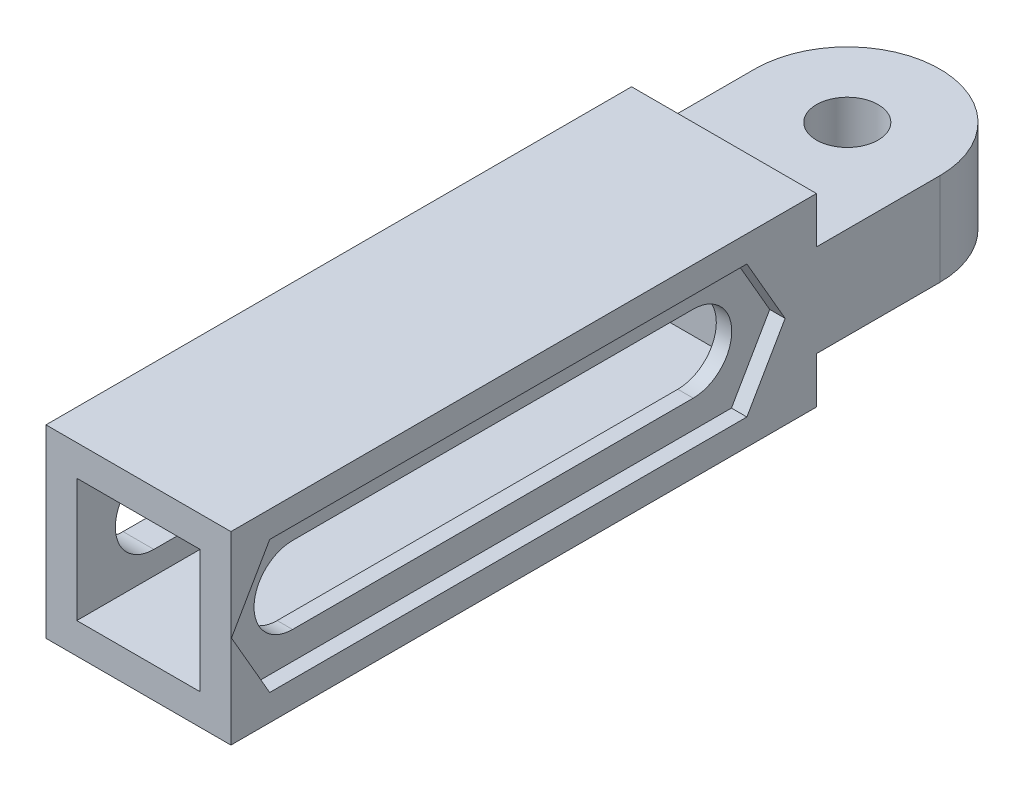
ISO-10303-21;
HEADER;
FILE_DESCRIPTION(('STEP AP214'),'2;1');
FILE_NAME('part.step','',(''),(''),'','','');
FILE_SCHEMA(('AUTOMOTIVE_DESIGN { 1 0 10303 214 1 1 1 1 }'));
ENDSEC;
DATA;
#1=APPLICATION_CONTEXT('core data for automotive mechanical design processes');
#2=APPLICATION_PROTOCOL_DEFINITION('international standard','automotive_design',2000,#1);
#3=PRODUCT_CONTEXT('',#1,'mechanical');
#4=PRODUCT('Part','Part','',(#3));
#5=PRODUCT_RELATED_PRODUCT_CATEGORY('part','',(#4));
#6=PRODUCT_DEFINITION_FORMATION('','',#4);
#7=PRODUCT_DEFINITION_CONTEXT('part definition',#1,'design');
#8=PRODUCT_DEFINITION('design','',#6,#7);
#9=PRODUCT_DEFINITION_SHAPE('','',#8);
#10=(LENGTH_UNIT() NAMED_UNIT(*) SI_UNIT(.MILLI.,.METRE.));
#11=(NAMED_UNIT(*) PLANE_ANGLE_UNIT() SI_UNIT($,.RADIAN.));
#12=(NAMED_UNIT(*) SI_UNIT($,.STERADIAN.) SOLID_ANGLE_UNIT());
#13=UNCERTAINTY_MEASURE_WITH_UNIT(LENGTH_MEASURE(1.E-05),#10,'distance_accuracy_value','');
#14=(GEOMETRIC_REPRESENTATION_CONTEXT(3) GLOBAL_UNCERTAINTY_ASSIGNED_CONTEXT((#13)) GLOBAL_UNIT_ASSIGNED_CONTEXT((#10,
#11,#12)) REPRESENTATION_CONTEXT('',''));
#15=CARTESIAN_POINT('',(0.,0.,0.));
#16=DIRECTION('',(0.,0.,1.));
#17=DIRECTION('',(1.,0.,0.));
#18=AXIS2_PLACEMENT_3D('',#15,#16,#17);
#19=CARTESIAN_POINT('',(18.7003184681076,0.,15.5));
#20=DIRECTION('',(-1.,0.,0.));
#21=DIRECTION('',(0.,-1.,0.));
#22=AXIS2_PLACEMENT_3D('',#19,#20,#21);
#23=CYLINDRICAL_SURFACE('',#22,1.25);
#24=CARTESIAN_POINT('',(2.5,0.,15.5));
#25=DIRECTION('',(1.,0.,0.));
#26=DIRECTION('',(0.,0.,-1.));
#27=AXIS2_PLACEMENT_3D('',#24,#25,#26);
#28=CIRCLE('',#27,1.25);
#29=CARTESIAN_POINT('',(2.5,-1.25,15.5));
#30=VERTEX_POINT('',#29);
#31=CARTESIAN_POINT('',(2.5,1.25,15.5));
#32=VERTEX_POINT('',#31);
#33=EDGE_CURVE('E55',#30,#32,#28,.F.);
#34=ORIENTED_EDGE('',*,*,#33,.F.);
#35=DIRECTION('',(-1.,0.,0.));
#36=VECTOR('',#35,1.);
#37=CARTESIAN_POINT('',(18.7003184681076,-1.25,15.5));
#38=LINE('',#37,#36);
#39=CARTESIAN_POINT('',(2.,-1.25,15.5));
#40=VERTEX_POINT('',#39);
#41=EDGE_CURVE('E277',#30,#40,#38,.T.);
#42=ORIENTED_EDGE('',*,*,#41,.T.);
#43=CARTESIAN_POINT('',(2.,0.,15.5));
#44=DIRECTION('',(-1.,0.,0.));
#45=DIRECTION('',(0.,0.,1.));
#46=AXIS2_PLACEMENT_3D('',#43,#44,#45);
#47=CIRCLE('',#46,1.25);
#48=CARTESIAN_POINT('',(2.,1.25,15.5));
#49=VERTEX_POINT('',#48);
#50=EDGE_CURVE('E297',#40,#49,#47,.T.);
#51=ORIENTED_EDGE('',*,*,#50,.T.);
#52=DIRECTION('',(-1.,0.,0.));
#53=VECTOR('',#52,1.);
#54=CARTESIAN_POINT('',(18.7003184681076,1.25,15.5));
#55=LINE('',#54,#53);
#56=EDGE_CURVE('E287',#32,#49,#55,.T.);
#57=ORIENTED_EDGE('',*,*,#56,.F.);
#58=EDGE_LOOP('',(#34,#42,#51,#57));
#59=FACE_BOUND('',#58,.T.);
#60=ADVANCED_FACE('F33',(#59),#23,.F.);
#61=CARTESIAN_POINT('',(18.7003184681076,-1.25,15.5));
#62=DIRECTION('',(0.,-1.,0.));
#63=DIRECTION('',(0.,0.,-1.));
#64=AXIS2_PLACEMENT_3D('',#61,#62,#63);
#65=PLANE('',#64);
#66=DIRECTION('',(0.,0.,1.));
#67=VECTOR('',#66,1.);
#68=CARTESIAN_POINT('',(2.5,-1.25,15.5));
#69=LINE('',#68,#67);
#70=CARTESIAN_POINT('',(2.5,-1.25,2.5));
#71=VERTEX_POINT('',#70);
#72=EDGE_CURVE('E262',#71,#30,#69,.T.);
#73=ORIENTED_EDGE('',*,*,#72,.F.);
#74=DIRECTION('',(-1.,0.,0.));
#75=VECTOR('',#74,1.);
#76=CARTESIAN_POINT('',(18.7003184681076,-1.25,2.5));
#77=LINE('',#76,#75);
#78=CARTESIAN_POINT('',(2.,-1.25,2.5));
#79=VERTEX_POINT('',#78);
#80=EDGE_CURVE('E281',#71,#79,#77,.T.);
#81=ORIENTED_EDGE('',*,*,#80,.T.);
#82=DIRECTION('',(0.,0.,1.));
#83=VECTOR('',#82,1.);
#84=CARTESIAN_POINT('',(2.,-1.25,18.));
#85=LINE('',#84,#83);
#86=EDGE_CURVE('E294',#79,#40,#85,.T.);
#87=ORIENTED_EDGE('',*,*,#86,.T.);
#88=ORIENTED_EDGE('',*,*,#41,.F.);
#89=EDGE_LOOP('',(#73,#81,#87,#88));
#90=FACE_BOUND('',#89,.T.);
#91=ADVANCED_FACE('F445',(#90),#65,.F.);
#92=CARTESIAN_POINT('',(18.7003184681076,0.,2.5));
#93=DIRECTION('',(-1.,0.,0.));
#94=DIRECTION('',(0.,-1.,0.));
#95=AXIS2_PLACEMENT_3D('',#92,#93,#94);
#96=CYLINDRICAL_SURFACE('',#95,1.25);
#97=CARTESIAN_POINT('',(2.5,0.,2.5));
#98=DIRECTION('',(1.,0.,0.));
#99=DIRECTION('',(0.,0.,-1.));
#100=AXIS2_PLACEMENT_3D('',#97,#98,#99);
#101=CIRCLE('',#100,1.25);
#102=CARTESIAN_POINT('',(2.5,1.25,2.5));
#103=VERTEX_POINT('',#102);
#104=EDGE_CURVE('E253',#103,#71,#101,.F.);
#105=ORIENTED_EDGE('',*,*,#104,.F.);
#106=DIRECTION('',(-1.,0.,0.));
#107=VECTOR('',#106,1.);
#108=CARTESIAN_POINT('',(18.7003184681076,1.25,2.5));
#109=LINE('',#108,#107);
#110=CARTESIAN_POINT('',(2.,1.25,2.5));
#111=VERTEX_POINT('',#110);
#112=EDGE_CURVE('E284',#103,#111,#109,.T.);
#113=ORIENTED_EDGE('',*,*,#112,.T.);
#114=CARTESIAN_POINT('',(2.,0.,2.5));
#115=DIRECTION('',(-1.,0.,0.));
#116=DIRECTION('',(0.,0.,1.));
#117=AXIS2_PLACEMENT_3D('',#114,#115,#116);
#118=CIRCLE('',#117,1.25);
#119=EDGE_CURVE('E291',#111,#79,#118,.T.);
#120=ORIENTED_EDGE('',*,*,#119,.T.);
#121=ORIENTED_EDGE('',*,*,#80,.F.);
#122=EDGE_LOOP('',(#105,#113,#120,#121));
#123=FACE_BOUND('',#122,.T.);
#124=ADVANCED_FACE('F436',(#123),#96,.F.);
#125=CARTESIAN_POINT('',(18.7003184681076,1.25,15.5));
#126=DIRECTION('',(0.,1.,0.));
#127=DIRECTION('',(0.,0.,1.));
#128=AXIS2_PLACEMENT_3D('',#125,#126,#127);
#129=PLANE('',#128);
#130=DIRECTION('',(0.,0.,-1.));
#131=VECTOR('',#130,1.);
#132=CARTESIAN_POINT('',(2.5,1.25,15.5));
#133=LINE('',#132,#131);
#134=EDGE_CURVE('E11',#32,#103,#133,.T.);
#135=ORIENTED_EDGE('',*,*,#134,.F.);
#136=ORIENTED_EDGE('',*,*,#56,.T.);
#137=DIRECTION('',(0.,0.,-1.));
#138=VECTOR('',#137,1.);
#139=CARTESIAN_POINT('',(2.,1.25,18.));
#140=LINE('',#139,#138);
#141=EDGE_CURVE('E279',#49,#111,#140,.T.);
#142=ORIENTED_EDGE('',*,*,#141,.T.);
#143=ORIENTED_EDGE('',*,*,#112,.F.);
#144=EDGE_LOOP('',(#135,#136,#142,#143));
#145=FACE_BOUND('',#144,.T.);
#146=ADVANCED_FACE('F430',(#145),#129,.F.);
#147=CARTESIAN_POINT('',(0.,0.,-1.));
#148=DIRECTION('',(0.,0.,1.));
#149=DIRECTION('',(1.,0.,0.));
#150=AXIS2_PLACEMENT_3D('',#147,#148,#149);
#151=PLANE('',#150);
#152=DIRECTION('',(1.,0.,0.));
#153=VECTOR('',#152,1.);
#154=CARTESIAN_POINT('',(3.,1.5,-1.));
#155=LINE('',#154,#153);
#156=CARTESIAN_POINT('',(-3.,1.5,-1.));
#157=VERTEX_POINT('',#156);
#158=CARTESIAN_POINT('',(3.,1.5,-1.));
#159=VERTEX_POINT('',#158);
#160=EDGE_CURVE('E308',#157,#159,#155,.T.);
#161=ORIENTED_EDGE('',*,*,#160,.F.);
#162=DIRECTION('',(0.,1.,0.));
#163=VECTOR('',#162,1.);
#164=CARTESIAN_POINT('',(-3.,3.,-1.));
#165=LINE('',#164,#163);
#166=CARTESIAN_POINT('',(-3.,3.,-1.));
#167=VERTEX_POINT('',#166);
#168=EDGE_CURVE('E331',#157,#167,#165,.T.);
#169=ORIENTED_EDGE('',*,*,#168,.T.);
#170=DIRECTION('',(1.,0.,0.));
#171=VECTOR('',#170,1.);
#172=CARTESIAN_POINT('',(-3.,3.,-1.));
#173=LINE('',#172,#171);
#174=CARTESIAN_POINT('',(3.,3.,-1.));
#175=VERTEX_POINT('',#174);
#176=EDGE_CURVE('E336',#167,#175,#173,.T.);
#177=ORIENTED_EDGE('',*,*,#176,.T.);
#178=DIRECTION('',(0.,-1.,0.));
#179=VECTOR('',#178,1.);
#180=CARTESIAN_POINT('',(3.,3.,-1.));
#181=LINE('',#180,#179);
#182=EDGE_CURVE('E340',#175,#159,#181,.T.);
#183=ORIENTED_EDGE('',*,*,#182,.T.);
#184=EDGE_LOOP('',(#161,#169,#177,#183));
#185=FACE_BOUND('',#184,.T.);
#186=ADVANCED_FACE('F442',(#185),#151,.F.);
#187=CARTESIAN_POINT('',(0.,0.,18.));
#188=DIRECTION('',(0.,0.,-1.));
#189=DIRECTION('',(-1.,0.,0.));
#190=AXIS2_PLACEMENT_3D('',#187,#188,#189);
#191=PLANE('',#190);
#192=DIRECTION('',(0.,1.,0.));
#193=VECTOR('',#192,1.);
#194=CARTESIAN_POINT('',(3.,3.,18.));
#195=LINE('',#194,#193);
#196=CARTESIAN_POINT('',(3.,-3.,18.));
#197=VERTEX_POINT('',#196);
#198=CARTESIAN_POINT('',(3.,3.,18.));
#199=VERTEX_POINT('',#198);
#200=EDGE_CURVE('E376',#197,#199,#195,.T.);
#201=ORIENTED_EDGE('',*,*,#200,.T.);
#202=DIRECTION('',(-1.,0.,0.));
#203=VECTOR('',#202,1.);
#204=CARTESIAN_POINT('',(3.,3.,18.));
#205=LINE('',#204,#203);
#206=CARTESIAN_POINT('',(-3.,3.,18.));
#207=VERTEX_POINT('',#206);
#208=EDGE_CURVE('E379',#199,#207,#205,.T.);
#209=ORIENTED_EDGE('',*,*,#208,.T.);
#210=DIRECTION('',(0.,-1.,0.));
#211=VECTOR('',#210,1.);
#212=CARTESIAN_POINT('',(-3.,3.,18.));
#213=LINE('',#212,#211);
#214=CARTESIAN_POINT('',(-3.,-3.,18.));
#215=VERTEX_POINT('',#214);
#216=EDGE_CURVE('E381',#207,#215,#213,.T.);
#217=ORIENTED_EDGE('',*,*,#216,.T.);
#218=DIRECTION('',(1.,0.,0.));
#219=VECTOR('',#218,1.);
#220=CARTESIAN_POINT('',(3.,-3.,18.));
#221=LINE('',#220,#219);
#222=EDGE_CURVE('E383',#215,#197,#221,.T.);
#223=ORIENTED_EDGE('',*,*,#222,.T.);
#224=EDGE_LOOP('',(#201,#209,#217,#223));
#225=FACE_BOUND('',#224,.T.);
#226=DIRECTION('',(0.,1.,0.));
#227=VECTOR('',#226,1.);
#228=CARTESIAN_POINT('',(2.,2.,18.));
#229=LINE('',#228,#227);
#230=CARTESIAN_POINT('',(2.,-2.,18.));
#231=VERTEX_POINT('',#230);
#232=CARTESIAN_POINT('',(2.,2.,18.));
#233=VERTEX_POINT('',#232);
#234=EDGE_CURVE('E347',#231,#233,#229,.T.);
#235=ORIENTED_EDGE('',*,*,#234,.F.);
#236=DIRECTION('',(1.,0.,0.));
#237=VECTOR('',#236,1.);
#238=CARTESIAN_POINT('',(2.,-2.,18.));
#239=LINE('',#238,#237);
#240=CARTESIAN_POINT('',(-2.,-2.,18.));
#241=VERTEX_POINT('',#240);
#242=EDGE_CURVE('E355',#241,#231,#239,.T.);
#243=ORIENTED_EDGE('',*,*,#242,.F.);
#244=DIRECTION('',(0.,-1.,0.));
#245=VECTOR('',#244,1.);
#246=CARTESIAN_POINT('',(-2.,2.,18.));
#247=LINE('',#246,#245);
#248=CARTESIAN_POINT('',(-2.,2.,18.));
#249=VERTEX_POINT('',#248);
#250=EDGE_CURVE('E352',#249,#241,#247,.T.);
#251=ORIENTED_EDGE('',*,*,#250,.F.);
#252=DIRECTION('',(-1.,0.,0.));
#253=VECTOR('',#252,1.);
#254=CARTESIAN_POINT('',(2.,2.,18.));
#255=LINE('',#254,#253);
#256=EDGE_CURVE('E349',#233,#249,#255,.T.);
#257=ORIENTED_EDGE('',*,*,#256,.F.);
#258=EDGE_LOOP('',(#235,#243,#251,#257));
#259=FACE_BOUND('',#258,.T.);
#260=ADVANCED_FACE('F622',(#225,#259),#191,.F.);
#261=CARTESIAN_POINT('',(3.,3.,18.));
#262=DIRECTION('',(-1.,0.,0.));
#263=DIRECTION('',(0.,-1.,0.));
#264=AXIS2_PLACEMENT_3D('',#261,#262,#263);
#265=PLANE('',#264);
#266=DIRECTION('',(0.,0.,1.));
#267=VECTOR('',#266,1.);
#268=CARTESIAN_POINT('',(3.,2.15,8.99999999999999));
#269=LINE('',#268,#267);
#270=CARTESIAN_POINT('',(3.,2.15,1.2586969212423));
#271=VERTEX_POINT('',#270);
#272=CARTESIAN_POINT('',(3.,2.15,16.7413030787577));
#273=VERTEX_POINT('',#272);
#274=EDGE_CURVE('E221',#271,#273,#269,.T.);
#275=ORIENTED_EDGE('',*,*,#274,.F.);
#276=DIRECTION('',(0.,0.866025403784438,0.500000000000001));
#277=VECTOR('',#276,1.);
#278=CARTESIAN_POINT('',(3.,0.,0.0173938424846071));
#279=LINE('',#278,#277);
#280=CARTESIAN_POINT('',(3.,0.,0.0173938424846071));
#281=VERTEX_POINT('',#280);
#282=EDGE_CURVE('E48',#281,#271,#279,.T.);
#283=ORIENTED_EDGE('',*,*,#282,.F.);
#284=DIRECTION('',(0.,0.866025403784439,-0.5));
#285=VECTOR('',#284,1.);
#286=CARTESIAN_POINT('',(3.,-2.15,1.2586969212423));
#287=LINE('',#286,#285);
#288=CARTESIAN_POINT('',(3.,-2.15,1.2586969212423));
#289=VERTEX_POINT('',#288);
#290=EDGE_CURVE('E247',#289,#281,#287,.T.);
#291=ORIENTED_EDGE('',*,*,#290,.F.);
#292=DIRECTION('',(0.,0.,-1.));
#293=VECTOR('',#292,1.);
#294=CARTESIAN_POINT('',(3.,-2.15,8.99999999999999));
#295=LINE('',#294,#293);
#296=CARTESIAN_POINT('',(3.,-2.15,16.7413030787577));
#297=VERTEX_POINT('',#296);
#298=EDGE_CURVE('E244',#297,#289,#295,.T.);
#299=ORIENTED_EDGE('',*,*,#298,.F.);
#300=DIRECTION('',(0.,-0.866025403784438,-0.500000000000001));
#301=VECTOR('',#300,1.);
#302=CARTESIAN_POINT('',(3.,0.,17.9826061575154));
#303=LINE('',#302,#301);
#304=CARTESIAN_POINT('',(3.,0.,17.9826061575154));
#305=VERTEX_POINT('',#304);
#306=EDGE_CURVE('E241',#305,#297,#303,.T.);
#307=ORIENTED_EDGE('',*,*,#306,.F.);
#308=DIRECTION('',(0.,-0.866025403784438,0.5));
#309=VECTOR('',#308,1.);
#310=CARTESIAN_POINT('',(3.,2.15,16.7413030787577));
#311=LINE('',#310,#309);
#312=EDGE_CURVE('E239',#273,#305,#311,.T.);
#313=ORIENTED_EDGE('',*,*,#312,.F.);
#314=EDGE_LOOP('',(#275,#283,#291,#299,#307,#313));
#315=FACE_BOUND('',#314,.T.);
#316=DIRECTION('',(0.,0.,-1.));
#317=VECTOR('',#316,1.);
#318=CARTESIAN_POINT('',(3.,-3.,18.));
#319=LINE('',#318,#317);
#320=CARTESIAN_POINT('',(3.,-3.,-1.));
#321=VERTEX_POINT('',#320);
#322=EDGE_CURVE('E385',#197,#321,#319,.T.);
#323=ORIENTED_EDGE('',*,*,#322,.T.);
#324=CARTESIAN_POINT('',(3.,-1.5,-1.));
#325=VERTEX_POINT('',#324);
#326=EDGE_CURVE('E339',#325,#321,#181,.T.);
#327=ORIENTED_EDGE('',*,*,#326,.F.);
#328=DIRECTION('',(0.,0.,-1.));
#329=VECTOR('',#328,1.);
#330=CARTESIAN_POINT('',(3.,-1.5,-5.));
#331=LINE('',#330,#329);
#332=CARTESIAN_POINT('',(3.,-1.5,-5.));
#333=VERTEX_POINT('',#332);
#334=EDGE_CURVE('E325',#325,#333,#331,.T.);
#335=ORIENTED_EDGE('',*,*,#334,.T.);
#336=DIRECTION('',(0.,1.,0.));
#337=VECTOR('',#336,1.);
#338=CARTESIAN_POINT('',(3.,-1.5,-5.));
#339=LINE('',#338,#337);
#340=CARTESIAN_POINT('',(3.,1.5,-5.));
#341=VERTEX_POINT('',#340);
#342=EDGE_CURVE('E329',#333,#341,#339,.T.);
#343=ORIENTED_EDGE('',*,*,#342,.T.);
#344=DIRECTION('',(0.,0.,-1.));
#345=VECTOR('',#344,1.);
#346=CARTESIAN_POINT('',(3.,1.5,-5.));
#347=LINE('',#346,#345);
#348=EDGE_CURVE('E310',#159,#341,#347,.T.);
#349=ORIENTED_EDGE('',*,*,#348,.F.);
#350=ORIENTED_EDGE('',*,*,#182,.F.);
#351=DIRECTION('',(0.,0.,-1.));
#352=VECTOR('',#351,1.);
#353=CARTESIAN_POINT('',(3.,3.,18.));
#354=LINE('',#353,#352);
#355=EDGE_CURVE('E393',#199,#175,#354,.T.);
#356=ORIENTED_EDGE('',*,*,#355,.F.);
#357=ORIENTED_EDGE('',*,*,#200,.F.);
#358=EDGE_LOOP('',(#323,#327,#335,#343,#349,#350,#356,#357));
#359=FACE_BOUND('',#358,.T.);
#360=ADVANCED_FACE('F35',(#315,#359),#265,.F.);
#361=CARTESIAN_POINT('',(3.,3.,18.));
#362=DIRECTION('',(0.,-1.,0.));
#363=DIRECTION('',(0.,0.,-1.));
#364=AXIS2_PLACEMENT_3D('',#361,#362,#363);
#365=PLANE('',#364);
#366=ORIENTED_EDGE('',*,*,#355,.T.);
#367=ORIENTED_EDGE('',*,*,#176,.F.);
#368=DIRECTION('',(0.,0.,-1.));
#369=VECTOR('',#368,1.);
#370=CARTESIAN_POINT('',(-3.,3.,18.));
#371=LINE('',#370,#369);
#372=EDGE_CURVE('E390',#207,#167,#371,.T.);
#373=ORIENTED_EDGE('',*,*,#372,.F.);
#374=ORIENTED_EDGE('',*,*,#208,.F.);
#375=EDGE_LOOP('',(#366,#367,#373,#374));
#376=FACE_BOUND('',#375,.T.);
#377=ADVANCED_FACE('F608',(#376),#365,.F.);
#378=CARTESIAN_POINT('',(-3.,3.,18.));
#379=DIRECTION('',(1.,0.,0.));
#380=DIRECTION('',(0.,1.,0.));
#381=AXIS2_PLACEMENT_3D('',#378,#379,#380);
#382=PLANE('',#381);
#383=DIRECTION('',(0.,0.,-1.));
#384=VECTOR('',#383,1.);
#385=CARTESIAN_POINT('',(-3.,1.25,15.5));
#386=LINE('',#385,#384);
#387=CARTESIAN_POINT('',(-3.,1.25,15.5));
#388=VERTEX_POINT('',#387);
#389=CARTESIAN_POINT('',(-3.,1.25,2.5));
#390=VERTEX_POINT('',#389);
#391=EDGE_CURVE('E267',#388,#390,#386,.T.);
#392=ORIENTED_EDGE('',*,*,#391,.F.);
#393=CARTESIAN_POINT('',(-3.,0.,15.5));
#394=DIRECTION('',(-1.,0.,0.));
#395=DIRECTION('',(0.,-1.,0.));
#396=AXIS2_PLACEMENT_3D('',#393,#394,#395);
#397=CIRCLE('',#396,1.25);
#398=CARTESIAN_POINT('',(-3.,-1.25,15.5));
#399=VERTEX_POINT('',#398);
#400=EDGE_CURVE('E265',#399,#388,#397,.T.);
#401=ORIENTED_EDGE('',*,*,#400,.F.);
#402=DIRECTION('',(0.,0.,1.));
#403=VECTOR('',#402,1.);
#404=CARTESIAN_POINT('',(-3.,-1.25,15.5));
#405=LINE('',#404,#403);
#406=CARTESIAN_POINT('',(-3.,-1.25,2.5));
#407=VERTEX_POINT('',#406);
#408=EDGE_CURVE('E273',#407,#399,#405,.T.);
#409=ORIENTED_EDGE('',*,*,#408,.F.);
#410=CARTESIAN_POINT('',(-3.,0.,2.5));
#411=DIRECTION('',(-1.,0.,0.));
#412=DIRECTION('',(0.,-1.,0.));
#413=AXIS2_PLACEMENT_3D('',#410,#411,#412);
#414=CIRCLE('',#413,1.25);
#415=EDGE_CURVE('E270',#390,#407,#414,.T.);
#416=ORIENTED_EDGE('',*,*,#415,.F.);
#417=EDGE_LOOP('',(#392,#401,#409,#416));
#418=FACE_BOUND('',#417,.T.);
#419=ORIENTED_EDGE('',*,*,#372,.T.);
#420=ORIENTED_EDGE('',*,*,#168,.F.);
#421=DIRECTION('',(0.,0.,1.));
#422=VECTOR('',#421,1.);
#423=CARTESIAN_POINT('',(-3.,1.5,-5.));
#424=LINE('',#423,#422);
#425=CARTESIAN_POINT('',(-3.,1.5,-5.));
#426=VERTEX_POINT('',#425);
#427=EDGE_CURVE('E306',#426,#157,#424,.T.);
#428=ORIENTED_EDGE('',*,*,#427,.F.);
#429=DIRECTION('',(0.,1.,0.));
#430=VECTOR('',#429,1.);
#431=CARTESIAN_POINT('',(-3.,-1.5,-5.));
#432=LINE('',#431,#430);
#433=CARTESIAN_POINT('',(-3.,-1.5,-5.));
#434=VERTEX_POINT('',#433);
#435=EDGE_CURVE('E328',#434,#426,#432,.T.);
#436=ORIENTED_EDGE('',*,*,#435,.F.);
#437=DIRECTION('',(0.,0.,1.));
#438=VECTOR('',#437,1.);
#439=CARTESIAN_POINT('',(-3.,-1.5,-5.));
#440=LINE('',#439,#438);
#441=CARTESIAN_POINT('',(-3.,-1.5,-1.));
#442=VERTEX_POINT('',#441);
#443=EDGE_CURVE('E319',#434,#442,#440,.T.);
#444=ORIENTED_EDGE('',*,*,#443,.T.);
#445=CARTESIAN_POINT('',(-3.,-3.,-1.));
#446=VERTEX_POINT('',#445);
#447=EDGE_CURVE('E333',#446,#442,#165,.T.);
#448=ORIENTED_EDGE('',*,*,#447,.F.);
#449=DIRECTION('',(0.,0.,-1.));
#450=VECTOR('',#449,1.);
#451=CARTESIAN_POINT('',(-3.,-3.,18.));
#452=LINE('',#451,#450);
#453=EDGE_CURVE('E388',#215,#446,#452,.T.);
#454=ORIENTED_EDGE('',*,*,#453,.F.);
#455=ORIENTED_EDGE('',*,*,#216,.F.);
#456=EDGE_LOOP('',(#419,#420,#428,#436,#444,#448,#454,#455));
#457=FACE_BOUND('',#456,.T.);
#458=ADVANCED_FACE('F423',(#418,#457),#382,.F.);
#459=CARTESIAN_POINT('',(3.,-3.,18.));
#460=DIRECTION('',(0.,1.,0.));
#461=DIRECTION('',(0.,0.,1.));
#462=AXIS2_PLACEMENT_3D('',#459,#460,#461);
#463=PLANE('',#462);
#464=ORIENTED_EDGE('',*,*,#453,.T.);
#465=DIRECTION('',(-1.,0.,0.));
#466=VECTOR('',#465,1.);
#467=CARTESIAN_POINT('',(-3.,-3.,-1.));
#468=LINE('',#467,#466);
#469=EDGE_CURVE('E343',#321,#446,#468,.T.);
#470=ORIENTED_EDGE('',*,*,#469,.F.);
#471=ORIENTED_EDGE('',*,*,#322,.F.);
#472=ORIENTED_EDGE('',*,*,#222,.F.);
#473=EDGE_LOOP('',(#464,#470,#471,#472));
#474=FACE_BOUND('',#473,.T.);
#475=ADVANCED_FACE('F607',(#474),#463,.F.);
#476=CARTESIAN_POINT('',(2.,2.,18.));
#477=DIRECTION('',(-1.,0.,0.));
#478=DIRECTION('',(0.,0.,1.));
#479=AXIS2_PLACEMENT_3D('',#476,#477,#478);
#480=PLANE('',#479);
#481=ORIENTED_EDGE('',*,*,#50,.F.);
#482=ORIENTED_EDGE('',*,*,#86,.F.);
#483=ORIENTED_EDGE('',*,*,#119,.F.);
#484=ORIENTED_EDGE('',*,*,#141,.F.);
#485=EDGE_LOOP('',(#481,#482,#483,#484));
#486=FACE_BOUND('',#485,.T.);
#487=DIRECTION('',(0.,1.,0.));
#488=VECTOR('',#487,1.);
#489=CARTESIAN_POINT('',(2.,2.,0.));
#490=LINE('',#489,#488);
#491=CARTESIAN_POINT('',(2.,-2.,0.));
#492=VERTEX_POINT('',#491);
#493=CARTESIAN_POINT('',(2.,2.,0.));
#494=VERTEX_POINT('',#493);
#495=EDGE_CURVE('E346',#492,#494,#490,.T.);
#496=ORIENTED_EDGE('',*,*,#495,.F.);
#497=DIRECTION('',(0.,0.,-1.));
#498=VECTOR('',#497,1.);
#499=CARTESIAN_POINT('',(2.,-2.,18.));
#500=LINE('',#499,#498);
#501=EDGE_CURVE('E357',#231,#492,#500,.T.);
#502=ORIENTED_EDGE('',*,*,#501,.F.);
#503=ORIENTED_EDGE('',*,*,#234,.T.);
#504=DIRECTION('',(0.,0.,-1.));
#505=VECTOR('',#504,1.);
#506=CARTESIAN_POINT('',(2.,2.,18.));
#507=LINE('',#506,#505);
#508=EDGE_CURVE('E373',#233,#494,#507,.T.);
#509=ORIENTED_EDGE('',*,*,#508,.T.);
#510=EDGE_LOOP('',(#496,#502,#503,#509));
#511=FACE_BOUND('',#510,.T.);
#512=ADVANCED_FACE('F658',(#486,#511),#480,.T.);
#513=CARTESIAN_POINT('',(2.,2.,18.));
#514=DIRECTION('',(0.,-1.,0.));
#515=DIRECTION('',(0.,0.,-1.));
#516=AXIS2_PLACEMENT_3D('',#513,#514,#515);
#517=PLANE('',#516);
#518=DIRECTION('',(-1.,0.,0.));
#519=VECTOR('',#518,1.);
#520=CARTESIAN_POINT('',(2.,2.,0.));
#521=LINE('',#520,#519);
#522=CARTESIAN_POINT('',(-2.,2.,0.));
#523=VERTEX_POINT('',#522);
#524=EDGE_CURVE('E360',#494,#523,#521,.T.);
#525=ORIENTED_EDGE('',*,*,#524,.F.);
#526=ORIENTED_EDGE('',*,*,#508,.F.);
#527=ORIENTED_EDGE('',*,*,#256,.T.);
#528=DIRECTION('',(0.,0.,-1.));
#529=VECTOR('',#528,1.);
#530=CARTESIAN_POINT('',(-2.,2.,18.));
#531=LINE('',#530,#529);
#532=EDGE_CURVE('E371',#249,#523,#531,.T.);
#533=ORIENTED_EDGE('',*,*,#532,.T.);
#534=EDGE_LOOP('',(#525,#526,#527,#533));
#535=FACE_BOUND('',#534,.T.);
#536=ADVANCED_FACE('F672',(#535),#517,.T.);
#537=CARTESIAN_POINT('',(-2.,2.,18.));
#538=DIRECTION('',(1.,0.,0.));
#539=DIRECTION('',(0.,0.,-1.));
#540=AXIS2_PLACEMENT_3D('',#537,#538,#539);
#541=PLANE('',#540);
#542=CARTESIAN_POINT('',(-2.,0.,15.5));
#543=DIRECTION('',(1.,0.,0.));
#544=DIRECTION('',(0.,0.,-1.));
#545=AXIS2_PLACEMENT_3D('',#542,#543,#544);
#546=CIRCLE('',#545,1.25);
#547=CARTESIAN_POINT('',(-2.,1.25,15.5));
#548=VERTEX_POINT('',#547);
#549=CARTESIAN_POINT('',(-2.,-1.25,15.5));
#550=VERTEX_POINT('',#549);
#551=EDGE_CURVE('E41',#548,#550,#546,.T.);
#552=ORIENTED_EDGE('',*,*,#551,.F.);
#553=DIRECTION('',(0.,0.,1.));
#554=VECTOR('',#553,1.);
#555=CARTESIAN_POINT('',(-2.,1.25,18.));
#556=LINE('',#555,#554);
#557=CARTESIAN_POINT('',(-2.,1.25,2.5));
#558=VERTEX_POINT('',#557);
#559=EDGE_CURVE('E395',#558,#548,#556,.T.);
#560=ORIENTED_EDGE('',*,*,#559,.F.);
#561=CARTESIAN_POINT('',(-2.,0.,2.5));
#562=DIRECTION('',(1.,0.,0.));
#563=DIRECTION('',(0.,0.,-1.));
#564=AXIS2_PLACEMENT_3D('',#561,#562,#563);
#565=CIRCLE('',#564,1.25);
#566=CARTESIAN_POINT('',(-2.,-1.25,2.5));
#567=VERTEX_POINT('',#566);
#568=EDGE_CURVE('E397',#567,#558,#565,.T.);
#569=ORIENTED_EDGE('',*,*,#568,.F.);
#570=DIRECTION('',(0.,0.,-1.));
#571=VECTOR('',#570,1.);
#572=CARTESIAN_POINT('',(-2.,-1.25,18.));
#573=LINE('',#572,#571);
#574=EDGE_CURVE('E400',#550,#567,#573,.T.);
#575=ORIENTED_EDGE('',*,*,#574,.F.);
#576=EDGE_LOOP('',(#552,#560,#569,#575));
#577=FACE_BOUND('',#576,.T.);
#578=DIRECTION('',(0.,-1.,0.));
#579=VECTOR('',#578,1.);
#580=CARTESIAN_POINT('',(-2.,2.,0.));
#581=LINE('',#580,#579);
#582=CARTESIAN_POINT('',(-2.,-2.,0.));
#583=VERTEX_POINT('',#582);
#584=EDGE_CURVE('E363',#523,#583,#581,.T.);
#585=ORIENTED_EDGE('',*,*,#584,.F.);
#586=ORIENTED_EDGE('',*,*,#532,.F.);
#587=ORIENTED_EDGE('',*,*,#250,.T.);
#588=DIRECTION('',(0.,0.,-1.));
#589=VECTOR('',#588,1.);
#590=CARTESIAN_POINT('',(-2.,-2.,18.));
#591=LINE('',#590,#589);
#592=EDGE_CURVE('E369',#241,#583,#591,.T.);
#593=ORIENTED_EDGE('',*,*,#592,.T.);
#594=EDGE_LOOP('',(#585,#586,#587,#593));
#595=FACE_BOUND('',#594,.T.);
#596=ADVANCED_FACE('F416',(#577,#595),#541,.T.);
#597=CARTESIAN_POINT('',(2.,-2.,18.));
#598=DIRECTION('',(0.,1.,0.));
#599=DIRECTION('',(0.,0.,1.));
#600=AXIS2_PLACEMENT_3D('',#597,#598,#599);
#601=PLANE('',#600);
#602=DIRECTION('',(1.,0.,0.));
#603=VECTOR('',#602,1.);
#604=CARTESIAN_POINT('',(2.,-2.,0.));
#605=LINE('',#604,#603);
#606=EDGE_CURVE('E350',#583,#492,#605,.T.);
#607=ORIENTED_EDGE('',*,*,#606,.F.);
#608=ORIENTED_EDGE('',*,*,#592,.F.);
#609=ORIENTED_EDGE('',*,*,#242,.T.);
#610=ORIENTED_EDGE('',*,*,#501,.T.);
#611=EDGE_LOOP('',(#607,#608,#609,#610));
#612=FACE_BOUND('',#611,.T.);
#613=ADVANCED_FACE('F648',(#612),#601,.T.);
#614=CARTESIAN_POINT('',(0.,0.,0.));
#615=DIRECTION('',(0.,0.,1.));
#616=DIRECTION('',(1.,0.,0.));
#617=AXIS2_PLACEMENT_3D('',#614,#615,#616);
#618=PLANE('',#617);
#619=ORIENTED_EDGE('',*,*,#606,.T.);
#620=ORIENTED_EDGE('',*,*,#495,.T.);
#621=ORIENTED_EDGE('',*,*,#524,.T.);
#622=ORIENTED_EDGE('',*,*,#584,.T.);
#623=EDGE_LOOP('',(#619,#620,#621,#622));
#624=FACE_BOUND('',#623,.T.);
#625=ADVANCED_FACE('F642',(#624),#618,.T.);
#626=ORIENTED_EDGE('',*,*,#447,.T.);
#627=DIRECTION('',(1.,0.,0.));
#628=VECTOR('',#627,1.);
#629=CARTESIAN_POINT('',(3.,-1.5,-1.));
#630=LINE('',#629,#628);
#631=EDGE_CURVE('E322',#442,#325,#630,.T.);
#632=ORIENTED_EDGE('',*,*,#631,.T.);
#633=ORIENTED_EDGE('',*,*,#326,.T.);
#634=ORIENTED_EDGE('',*,*,#469,.T.);
#635=EDGE_LOOP('',(#626,#632,#633,#634));
#636=FACE_BOUND('',#635,.T.);
#637=ADVANCED_FACE('F597',(#636),#151,.F.);
#638=CARTESIAN_POINT('',(0.,-1.5,-5.));
#639=DIRECTION('',(0.,1.,0.));
#640=DIRECTION('',(0.,0.,1.));
#641=AXIS2_PLACEMENT_3D('',#638,#639,#640);
#642=CYLINDRICAL_SURFACE('',#641,3.);
#643=ORIENTED_EDGE('',*,*,#435,.T.);
#644=CARTESIAN_POINT('',(0.,1.5,-5.));
#645=DIRECTION('',(0.,1.,0.));
#646=DIRECTION('',(0.,0.,1.));
#647=AXIS2_PLACEMENT_3D('',#644,#645,#646);
#648=CIRCLE('',#647,3.);
#649=EDGE_CURVE('E303',#341,#426,#648,.T.);
#650=ORIENTED_EDGE('',*,*,#649,.F.);
#651=ORIENTED_EDGE('',*,*,#342,.F.);
#652=CARTESIAN_POINT('',(0.,-1.5,-5.));
#653=DIRECTION('',(0.,1.,0.));
#654=DIRECTION('',(0.,0.,1.));
#655=AXIS2_PLACEMENT_3D('',#652,#653,#654);
#656=CIRCLE('',#655,3.);
#657=EDGE_CURVE('E316',#333,#434,#656,.T.);
#658=ORIENTED_EDGE('',*,*,#657,.T.);
#659=EDGE_LOOP('',(#643,#650,#651,#658));
#660=FACE_BOUND('',#659,.T.);
#661=ADVANCED_FACE('F588',(#660),#642,.T.);
#662=CARTESIAN_POINT('',(0.,-1.5,-5.));
#663=DIRECTION('',(0.,1.,0.));
#664=DIRECTION('',(0.,0.,1.));
#665=AXIS2_PLACEMENT_3D('',#662,#663,#664);
#666=PLANE('',#665);
#667=CARTESIAN_POINT('',(0.,-1.5,-5.));
#668=DIRECTION('',(0.,1.,0.));
#669=DIRECTION('',(0.,0.,1.));
#670=AXIS2_PLACEMENT_3D('',#667,#668,#669);
#671=CIRCLE('',#670,1.);
#672=CARTESIAN_POINT('',(0.,-1.5,-4.));
#673=VERTEX_POINT('',#672);
#674=EDGE_CURVE('E313',#673,#673,#671,.T.);
#675=ORIENTED_EDGE('',*,*,#674,.T.);
#676=EDGE_LOOP('',(#675));
#677=FACE_BOUND('',#676,.T.);
#678=ORIENTED_EDGE('',*,*,#657,.F.);
#679=ORIENTED_EDGE('',*,*,#334,.F.);
#680=ORIENTED_EDGE('',*,*,#631,.F.);
#681=ORIENTED_EDGE('',*,*,#443,.F.);
#682=EDGE_LOOP('',(#678,#679,#680,#681));
#683=FACE_BOUND('',#682,.T.);
#684=ADVANCED_FACE('F579',(#677,#683),#666,.F.);
#685=CARTESIAN_POINT('',(0.,-1.5,-5.));
#686=DIRECTION('',(0.,1.,0.));
#687=DIRECTION('',(0.,0.,1.));
#688=AXIS2_PLACEMENT_3D('',#685,#686,#687);
#689=CYLINDRICAL_SURFACE('',#688,1.);
#690=ORIENTED_EDGE('',*,*,#674,.F.);
#691=EDGE_LOOP('',(#690));
#692=FACE_BOUND('',#691,.T.);
#693=CARTESIAN_POINT('',(0.,1.5,-5.));
#694=DIRECTION('',(0.,1.,0.));
#695=DIRECTION('',(0.,0.,1.));
#696=AXIS2_PLACEMENT_3D('',#693,#694,#695);
#697=CIRCLE('',#696,1.);
#698=CARTESIAN_POINT('',(0.,1.5,-4.));
#699=VERTEX_POINT('',#698);
#700=EDGE_CURVE('E300',#699,#699,#697,.T.);
#701=ORIENTED_EDGE('',*,*,#700,.T.);
#702=EDGE_LOOP('',(#701));
#703=FACE_BOUND('',#702,.T.);
#704=ADVANCED_FACE('F437',(#692,#703),#689,.F.);
#705=CARTESIAN_POINT('',(0.,1.5,-5.));
#706=DIRECTION('',(0.,1.,0.));
#707=DIRECTION('',(0.,0.,1.));
#708=AXIS2_PLACEMENT_3D('',#705,#706,#707);
#709=PLANE('',#708);
#710=ORIENTED_EDGE('',*,*,#649,.T.);
#711=ORIENTED_EDGE('',*,*,#427,.T.);
#712=ORIENTED_EDGE('',*,*,#160,.T.);
#713=ORIENTED_EDGE('',*,*,#348,.T.);
#714=EDGE_LOOP('',(#710,#711,#712,#713));
#715=FACE_BOUND('',#714,.T.);
#716=ORIENTED_EDGE('',*,*,#700,.F.);
#717=EDGE_LOOP('',(#716));
#718=FACE_BOUND('',#717,.T.);
#719=ADVANCED_FACE('F428',(#715,#718),#709,.T.);
#720=ORIENTED_EDGE('',*,*,#559,.T.);
#721=EDGE_CURVE('E276',#548,#388,#55,.T.);
#722=ORIENTED_EDGE('',*,*,#721,.T.);
#723=ORIENTED_EDGE('',*,*,#391,.T.);
#724=EDGE_CURVE('E286',#558,#390,#109,.T.);
#725=ORIENTED_EDGE('',*,*,#724,.F.);
#726=EDGE_LOOP('',(#720,#722,#723,#725));
#727=FACE_BOUND('',#726,.T.);
#728=ADVANCED_FACE('F426',(#727),#129,.F.);
#729=ORIENTED_EDGE('',*,*,#568,.T.);
#730=ORIENTED_EDGE('',*,*,#724,.T.);
#731=ORIENTED_EDGE('',*,*,#415,.T.);
#732=EDGE_CURVE('E283',#567,#407,#77,.T.);
#733=ORIENTED_EDGE('',*,*,#732,.F.);
#734=EDGE_LOOP('',(#729,#730,#731,#733));
#735=FACE_BOUND('',#734,.T.);
#736=ADVANCED_FACE('F419',(#735),#96,.F.);
#737=ORIENTED_EDGE('',*,*,#574,.T.);
#738=ORIENTED_EDGE('',*,*,#732,.T.);
#739=ORIENTED_EDGE('',*,*,#408,.T.);
#740=EDGE_CURVE('E280',#550,#399,#38,.T.);
#741=ORIENTED_EDGE('',*,*,#740,.F.);
#742=EDGE_LOOP('',(#737,#738,#739,#741));
#743=FACE_BOUND('',#742,.T.);
#744=ADVANCED_FACE('F411',(#743),#65,.F.);
#745=ORIENTED_EDGE('',*,*,#551,.T.);
#746=ORIENTED_EDGE('',*,*,#740,.T.);
#747=ORIENTED_EDGE('',*,*,#400,.T.);
#748=ORIENTED_EDGE('',*,*,#721,.F.);
#749=EDGE_LOOP('',(#745,#746,#747,#748));
#750=FACE_BOUND('',#749,.T.);
#751=ADVANCED_FACE('F405',(#750),#23,.F.);
#752=CARTESIAN_POINT('',(2.5,0.,0.));
#753=DIRECTION('',(1.,0.,0.));
#754=DIRECTION('',(0.,0.,-1.));
#755=AXIS2_PLACEMENT_3D('',#752,#753,#754);
#756=PLANE('',#755);
#757=DIRECTION('',(0.,0.,1.));
#758=VECTOR('',#757,1.);
#759=CARTESIAN_POINT('',(2.5,2.15,1.2586969212423));
#760=LINE('',#759,#758);
#761=CARTESIAN_POINT('',(2.5,2.15,1.2586969212423));
#762=VERTEX_POINT('',#761);
#763=CARTESIAN_POINT('',(2.5,2.15,16.7413030787577));
#764=VERTEX_POINT('',#763);
#765=EDGE_CURVE('E206',#762,#764,#760,.T.);
#766=ORIENTED_EDGE('',*,*,#765,.T.);
#767=DIRECTION('',(0.,-0.866025403784438,0.5));
#768=VECTOR('',#767,1.);
#769=CARTESIAN_POINT('',(2.5,2.15,16.7413030787577));
#770=LINE('',#769,#768);
#771=CARTESIAN_POINT('',(2.5,0.,17.9826061575154));
#772=VERTEX_POINT('',#771);
#773=EDGE_CURVE('E211',#764,#772,#770,.T.);
#774=ORIENTED_EDGE('',*,*,#773,.T.);
#775=DIRECTION('',(0.,-0.866025403784438,-0.500000000000001));
#776=VECTOR('',#775,1.);
#777=CARTESIAN_POINT('',(2.5,0.,17.9826061575154));
#778=LINE('',#777,#776);
#779=CARTESIAN_POINT('',(2.5,-2.15,16.7413030787577));
#780=VERTEX_POINT('',#779);
#781=EDGE_CURVE('E229',#772,#780,#778,.T.);
#782=ORIENTED_EDGE('',*,*,#781,.T.);
#783=DIRECTION('',(0.,0.,-1.));
#784=VECTOR('',#783,1.);
#785=CARTESIAN_POINT('',(2.5,-2.15,16.7413030787577));
#786=LINE('',#785,#784);
#787=CARTESIAN_POINT('',(2.5,-2.15,1.2586969212423));
#788=VERTEX_POINT('',#787);
#789=EDGE_CURVE('E231',#780,#788,#786,.T.);
#790=ORIENTED_EDGE('',*,*,#789,.T.);
#791=DIRECTION('',(0.,0.866025403784439,-0.5));
#792=VECTOR('',#791,1.);
#793=CARTESIAN_POINT('',(2.5,-2.15,1.2586969212423));
#794=LINE('',#793,#792);
#795=CARTESIAN_POINT('',(2.5,0.,0.0173938424846071));
#796=VERTEX_POINT('',#795);
#797=EDGE_CURVE('E235',#788,#796,#794,.T.);
#798=ORIENTED_EDGE('',*,*,#797,.T.);
#799=DIRECTION('',(0.,0.866025403784438,0.500000000000001));
#800=VECTOR('',#799,1.);
#801=CARTESIAN_POINT('',(2.5,0.,0.0173938424846071));
#802=LINE('',#801,#800);
#803=EDGE_CURVE('E214',#796,#762,#802,.T.);
#804=ORIENTED_EDGE('',*,*,#803,.T.);
#805=EDGE_LOOP('',(#766,#774,#782,#790,#798,#804));
#806=FACE_BOUND('',#805,.T.);
#807=ORIENTED_EDGE('',*,*,#33,.T.);
#808=ORIENTED_EDGE('',*,*,#134,.T.);
#809=ORIENTED_EDGE('',*,*,#104,.T.);
#810=ORIENTED_EDGE('',*,*,#72,.T.);
#811=EDGE_LOOP('',(#807,#808,#809,#810));
#812=FACE_BOUND('',#811,.T.);
#813=ADVANCED_FACE('F208',(#806,#812),#756,.T.);
#814=CARTESIAN_POINT('',(2.5,0.,0.0173938424846071));
#815=DIRECTION('',(0.,0.500000000000001,-0.866025403784438));
#816=DIRECTION('',(0.,0.866025403784438,0.500000000000001));
#817=AXIS2_PLACEMENT_3D('',#814,#815,#816);
#818=PLANE('',#817);
#819=ORIENTED_EDGE('',*,*,#282,.T.);
#820=DIRECTION('',(1.,0.,0.));
#821=VECTOR('',#820,1.);
#822=CARTESIAN_POINT('',(2.5,2.15,1.2586969212423));
#823=LINE('',#822,#821);
#824=EDGE_CURVE('E251',#762,#271,#823,.T.);
#825=ORIENTED_EDGE('',*,*,#824,.F.);
#826=ORIENTED_EDGE('',*,*,#803,.F.);
#827=DIRECTION('',(1.,0.,0.));
#828=VECTOR('',#827,1.);
#829=CARTESIAN_POINT('',(2.5,0.,0.0173938424846071));
#830=LINE('',#829,#828);
#831=EDGE_CURVE('E254',#796,#281,#830,.T.);
#832=ORIENTED_EDGE('',*,*,#831,.T.);
#833=EDGE_LOOP('',(#819,#825,#826,#832));
#834=FACE_BOUND('',#833,.T.);
#835=ADVANCED_FACE('F457',(#834),#818,.F.);
#836=CARTESIAN_POINT('',(2.5,-2.15,1.2586969212423));
#837=DIRECTION('',(0.,-0.5,-0.866025403784439));
#838=DIRECTION('',(0.,0.866025403784439,-0.5));
#839=AXIS2_PLACEMENT_3D('',#836,#837,#838);
#840=PLANE('',#839);
#841=ORIENTED_EDGE('',*,*,#290,.T.);
#842=ORIENTED_EDGE('',*,*,#831,.F.);
#843=ORIENTED_EDGE('',*,*,#797,.F.);
#844=DIRECTION('',(1.,0.,0.));
#845=VECTOR('',#844,1.);
#846=CARTESIAN_POINT('',(2.5,-2.15,1.2586969212423));
#847=LINE('',#846,#845);
#848=EDGE_CURVE('E256',#788,#289,#847,.T.);
#849=ORIENTED_EDGE('',*,*,#848,.T.);
#850=EDGE_LOOP('',(#841,#842,#843,#849));
#851=FACE_BOUND('',#850,.T.);
#852=ADVANCED_FACE('F473',(#851),#840,.F.);
#853=CARTESIAN_POINT('',(2.5,-2.15,8.99999999999999));
#854=DIRECTION('',(0.,-1.,0.));
#855=DIRECTION('',(0.,0.,-1.));
#856=AXIS2_PLACEMENT_3D('',#853,#854,#855);
#857=PLANE('',#856);
#858=ORIENTED_EDGE('',*,*,#298,.T.);
#859=ORIENTED_EDGE('',*,*,#848,.F.);
#860=ORIENTED_EDGE('',*,*,#789,.F.);
#861=DIRECTION('',(1.,0.,0.));
#862=VECTOR('',#861,1.);
#863=CARTESIAN_POINT('',(2.5,-2.15,16.7413030787577));
#864=LINE('',#863,#862);
#865=EDGE_CURVE('E258',#780,#297,#864,.T.);
#866=ORIENTED_EDGE('',*,*,#865,.T.);
#867=EDGE_LOOP('',(#858,#859,#860,#866));
#868=FACE_BOUND('',#867,.T.);
#869=ADVANCED_FACE('F469',(#868),#857,.F.);
#870=CARTESIAN_POINT('',(2.5,0.,17.9826061575154));
#871=DIRECTION('',(0.,-0.500000000000001,0.866025403784438));
#872=DIRECTION('',(0.,-0.866025403784438,-0.500000000000001));
#873=AXIS2_PLACEMENT_3D('',#870,#871,#872);
#874=PLANE('',#873);
#875=ORIENTED_EDGE('',*,*,#306,.T.);
#876=ORIENTED_EDGE('',*,*,#865,.F.);
#877=ORIENTED_EDGE('',*,*,#781,.F.);
#878=DIRECTION('',(1.,0.,0.));
#879=VECTOR('',#878,1.);
#880=CARTESIAN_POINT('',(2.5,0.,17.9826061575154));
#881=LINE('',#880,#879);
#882=EDGE_CURVE('E225',#772,#305,#881,.T.);
#883=ORIENTED_EDGE('',*,*,#882,.T.);
#884=EDGE_LOOP('',(#875,#876,#877,#883));
#885=FACE_BOUND('',#884,.T.);
#886=ADVANCED_FACE('F466',(#885),#874,.F.);
#887=CARTESIAN_POINT('',(2.5,2.15,16.7413030787577));
#888=DIRECTION('',(0.,0.5,0.866025403784438));
#889=DIRECTION('',(0.,-0.866025403784438,0.5));
#890=AXIS2_PLACEMENT_3D('',#887,#888,#889);
#891=PLANE('',#890);
#892=ORIENTED_EDGE('',*,*,#312,.T.);
#893=ORIENTED_EDGE('',*,*,#882,.F.);
#894=ORIENTED_EDGE('',*,*,#773,.F.);
#895=DIRECTION('',(1.,0.,0.));
#896=VECTOR('',#895,1.);
#897=CARTESIAN_POINT('',(2.5,2.15,16.7413030787577));
#898=LINE('',#897,#896);
#899=EDGE_CURVE('E218',#764,#273,#898,.T.);
#900=ORIENTED_EDGE('',*,*,#899,.T.);
#901=EDGE_LOOP('',(#892,#893,#894,#900));
#902=FACE_BOUND('',#901,.T.);
#903=ADVANCED_FACE('F227',(#902),#891,.F.);
#904=CARTESIAN_POINT('',(2.5,2.15,8.99999999999999));
#905=DIRECTION('',(0.,1.,0.));
#906=DIRECTION('',(0.,0.,1.));
#907=AXIS2_PLACEMENT_3D('',#904,#905,#906);
#908=PLANE('',#907);
#909=ORIENTED_EDGE('',*,*,#274,.T.);
#910=ORIENTED_EDGE('',*,*,#899,.F.);
#911=ORIENTED_EDGE('',*,*,#765,.F.);
#912=ORIENTED_EDGE('',*,*,#824,.T.);
#913=EDGE_LOOP('',(#909,#910,#911,#912));
#914=FACE_BOUND('',#913,.T.);
#915=ADVANCED_FACE('F219',(#914),#908,.F.);
#916=CLOSED_SHELL('',(#60,#91,#124,#146,#186,#260,#360,#377,#458,#475,#512,#536,#596,#613,#625,
#637,#661,#684,#704,#719,#728,#736,#744,#751,#813,#835,#852,#869,#886,#903,#915));
#917=MANIFOLD_SOLID_BREP('B2',#916);
#918=ADVANCED_BREP_SHAPE_REPRESENTATION('',(#18,#917),#14);
#919=SHAPE_DEFINITION_REPRESENTATION(#9,#918);
ENDSEC;
END-ISO-10303-21;
